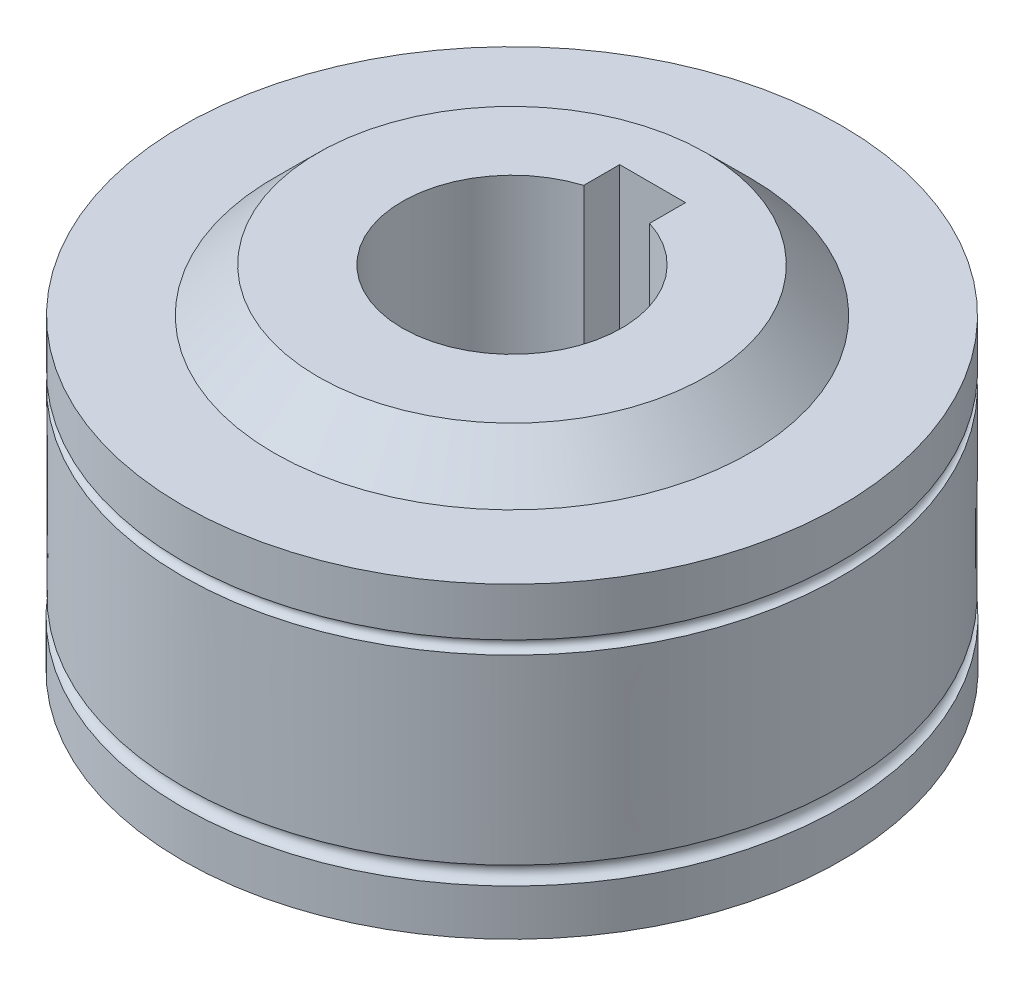
ISO-10303-21;
HEADER;
FILE_DESCRIPTION(('STEP AP214'),'2;1');
FILE_NAME('part.step','',(''),(''),'','','');
FILE_SCHEMA(('AUTOMOTIVE_DESIGN { 1 0 10303 214 1 1 1 1 }'));
ENDSEC;
DATA;
#1=APPLICATION_CONTEXT('core data for automotive mechanical design processes');
#2=APPLICATION_PROTOCOL_DEFINITION('international standard','automotive_design',2000,#1);
#3=PRODUCT_CONTEXT('',#1,'mechanical');
#4=PRODUCT('Part','Part','',(#3));
#5=PRODUCT_RELATED_PRODUCT_CATEGORY('part','',(#4));
#6=PRODUCT_DEFINITION_FORMATION('','',#4);
#7=PRODUCT_DEFINITION_CONTEXT('part definition',#1,'design');
#8=PRODUCT_DEFINITION('design','',#6,#7);
#9=PRODUCT_DEFINITION_SHAPE('','',#8);
#10=(LENGTH_UNIT() NAMED_UNIT(*) SI_UNIT(.MILLI.,.METRE.));
#11=(NAMED_UNIT(*) PLANE_ANGLE_UNIT() SI_UNIT($,.RADIAN.));
#12=(NAMED_UNIT(*) SI_UNIT($,.STERADIAN.) SOLID_ANGLE_UNIT());
#13=UNCERTAINTY_MEASURE_WITH_UNIT(LENGTH_MEASURE(1.E-05),#10,'distance_accuracy_value','');
#14=(GEOMETRIC_REPRESENTATION_CONTEXT(3) GLOBAL_UNCERTAINTY_ASSIGNED_CONTEXT((#13)) GLOBAL_UNIT_ASSIGNED_CONTEXT((#10,
#11,#12)) REPRESENTATION_CONTEXT('',''));
#15=CARTESIAN_POINT('',(0.,0.,0.));
#16=DIRECTION('',(0.,0.,1.));
#17=DIRECTION('',(1.,0.,0.));
#18=AXIS2_PLACEMENT_3D('',#15,#16,#17);
#19=CARTESIAN_POINT('',(0.,-9.,-8.84002342260273));
#20=DIRECTION('',(0.,-1.,0.));
#21=DIRECTION('',(0.,0.,-1.));
#22=AXIS2_PLACEMENT_3D('',#19,#20,#21);
#23=PLANE('',#22);
#24=DIRECTION('',(0.,0.,1.));
#25=VECTOR('',#24,1.);
#26=CARTESIAN_POINT('',(-1.5,-9.,-4.));
#27=LINE('',#26,#25);
#28=CARTESIAN_POINT('',(-1.5,-9.,-6.4056612472711));
#29=VERTEX_POINT('',#28);
#30=CARTESIAN_POINT('',(-1.5,-9.,-4.76969600708473));
#31=VERTEX_POINT('',#30);
#32=EDGE_CURVE('E81',#29,#31,#27,.T.);
#33=ORIENTED_EDGE('',*,*,#32,.T.);
#34=CARTESIAN_POINT('',(0.,-9.,0.));
#35=DIRECTION('',(0.,1.,0.));
#36=DIRECTION('',(0.,0.,1.));
#37=AXIS2_PLACEMENT_3D('',#34,#35,#36);
#38=CIRCLE('',#37,5.);
#39=CARTESIAN_POINT('',(1.5,-9.,-4.76969600708473));
#40=VERTEX_POINT('',#39);
#41=EDGE_CURVE('E91',#31,#40,#38,.T.);
#42=ORIENTED_EDGE('',*,*,#41,.T.);
#43=DIRECTION('',(0.,0.,-1.));
#44=VECTOR('',#43,1.);
#45=CARTESIAN_POINT('',(1.5,-9.,-6.4056612472711));
#46=LINE('',#45,#44);
#47=CARTESIAN_POINT('',(1.5,-9.,-6.4056612472711));
#48=VERTEX_POINT('',#47);
#49=EDGE_CURVE('E49',#40,#48,#46,.T.);
#50=ORIENTED_EDGE('',*,*,#49,.T.);
#51=DIRECTION('',(-1.,0.,0.));
#52=VECTOR('',#51,1.);
#53=CARTESIAN_POINT('',(-1.5,-9.,-6.4056612472711));
#54=LINE('',#53,#52);
#55=EDGE_CURVE('E84',#48,#29,#54,.T.);
#56=ORIENTED_EDGE('',*,*,#55,.T.);
#57=EDGE_LOOP('',(#33,#42,#50,#56));
#58=FACE_BOUND('',#57,.T.);
#59=CARTESIAN_POINT('',(0.,-8.99999999999999,0.));
#60=DIRECTION('',(0.,1.,0.));
#61=DIRECTION('',(0.,0.,1.));
#62=AXIS2_PLACEMENT_3D('',#59,#60,#61);
#63=CIRCLE('',#62,8.84002342260272);
#64=CARTESIAN_POINT('',(0.,-9.,8.84002342260272));
#65=VERTEX_POINT('',#64);
#66=EDGE_CURVE('E132',#65,#65,#63,.T.);
#67=ORIENTED_EDGE('',*,*,#66,.F.);
#68=EDGE_LOOP('',(#67));
#69=FACE_BOUND('',#68,.T.);
#70=ADVANCED_FACE('F35',(#58,#69),#23,.T.);
#71=CARTESIAN_POINT('',(0.,-7.,0.));
#72=DIRECTION('',(0.,1.,0.));
#73=DIRECTION('',(0.,0.,1.));
#74=AXIS2_PLACEMENT_3D('',#71,#72,#73);
#75=CONICAL_SURFACE('',#74,10.8508824151108,0.788105555005152);
#76=ORIENTED_EDGE('',*,*,#66,.T.);
#77=EDGE_LOOP('',(#76));
#78=FACE_BOUND('',#77,.T.);
#79=CARTESIAN_POINT('',(0.,-7.,0.));
#80=DIRECTION('',(0.,1.,0.));
#81=DIRECTION('',(0.,0.,1.));
#82=AXIS2_PLACEMENT_3D('',#79,#80,#81);
#83=CIRCLE('',#82,10.8508824151108);
#84=CARTESIAN_POINT('',(0.,-7.,10.8508824151108));
#85=VERTEX_POINT('',#84);
#86=EDGE_CURVE('E129',#85,#85,#83,.T.);
#87=ORIENTED_EDGE('',*,*,#86,.F.);
#88=EDGE_LOOP('',(#87));
#89=FACE_BOUND('',#88,.T.);
#90=ADVANCED_FACE('F153',(#78,#89),#75,.T.);
#91=CARTESIAN_POINT('',(0.,-7.,-15.01730453128));
#92=DIRECTION('',(0.,-1.,0.));
#93=DIRECTION('',(0.,0.,-1.));
#94=AXIS2_PLACEMENT_3D('',#91,#92,#93);
#95=PLANE('',#94);
#96=ORIENTED_EDGE('',*,*,#86,.T.);
#97=EDGE_LOOP('',(#96));
#98=FACE_BOUND('',#97,.T.);
#99=CARTESIAN_POINT('',(0.,-7.,0.));
#100=DIRECTION('',(0.,1.,0.));
#101=DIRECTION('',(0.,0.,1.));
#102=AXIS2_PLACEMENT_3D('',#99,#100,#101);
#103=CIRCLE('',#102,15.01730453128);
#104=CARTESIAN_POINT('',(0.,-7.,15.01730453128));
#105=VERTEX_POINT('',#104);
#106=EDGE_CURVE('E126',#105,#105,#103,.T.);
#107=ORIENTED_EDGE('',*,*,#106,.F.);
#108=EDGE_LOOP('',(#107));
#109=FACE_BOUND('',#108,.T.);
#110=ADVANCED_FACE('F157',(#98,#109),#95,.T.);
#111=CARTESIAN_POINT('',(0.,26.6331730643921,0.));
#112=DIRECTION('',(0.,1.,0.));
#113=DIRECTION('',(0.,0.,1.));
#114=AXIS2_PLACEMENT_3D('',#111,#112,#113);
#115=CYLINDRICAL_SURFACE('',#114,15.01730453128);
#116=CARTESIAN_POINT('',(0.,-4.89962551619882,0.));
#117=DIRECTION('',(0.,1.,0.));
#118=DIRECTION('',(0.,0.,1.));
#119=AXIS2_PLACEMENT_3D('',#116,#117,#118);
#120=CIRCLE('',#119,15.01730453128);
#121=CARTESIAN_POINT('',(0.,-4.89962551619883,15.01730453128));
#122=VERTEX_POINT('',#121);
#123=EDGE_CURVE('E123',#122,#122,#120,.T.);
#124=ORIENTED_EDGE('',*,*,#123,.F.);
#125=EDGE_LOOP('',(#124));
#126=FACE_BOUND('',#125,.T.);
#127=ORIENTED_EDGE('',*,*,#106,.T.);
#128=EDGE_LOOP('',(#127));
#129=FACE_BOUND('',#128,.T.);
#130=ADVANCED_FACE('F162',(#126,#129),#115,.T.);
#131=CARTESIAN_POINT('',(0.,-4.5,0.));
#132=DIRECTION('',(0.,1.,0.));
#133=DIRECTION('',(0.,0.,1.));
#134=AXIS2_PLACEMENT_3D('',#131,#132,#133);
#135=TOROIDAL_SURFACE('',#134,15.,0.399999999999999);
#136=CARTESIAN_POINT('',(0.,-4.10037448380117,0.));
#137=DIRECTION('',(0.,1.,0.));
#138=DIRECTION('',(0.,0.,1.));
#139=AXIS2_PLACEMENT_3D('',#136,#137,#138);
#140=CIRCLE('',#139,14.98269546872);
#141=CARTESIAN_POINT('',(0.,-4.10037448380117,14.98269546872));
#142=VERTEX_POINT('',#141);
#143=EDGE_CURVE('E120',#142,#142,#140,.T.);
#144=ORIENTED_EDGE('',*,*,#143,.F.);
#145=EDGE_LOOP('',(#144));
#146=FACE_BOUND('',#145,.T.);
#147=ORIENTED_EDGE('',*,*,#123,.T.);
#148=EDGE_LOOP('',(#147));
#149=FACE_BOUND('',#148,.T.);
#150=ADVANCED_FACE('F169',(#146,#149),#135,.F.);
#151=CARTESIAN_POINT('',(0.,4.2,0.));
#152=DIRECTION('',(0.,1.,0.));
#153=DIRECTION('',(0.,0.,1.));
#154=AXIS2_PLACEMENT_3D('',#151,#152,#153);
#155=CONICAL_SURFACE('',#154,15.,0.00208478620372108);
#156=ORIENTED_EDGE('',*,*,#143,.T.);
#157=EDGE_LOOP('',(#156));
#158=FACE_BOUND('',#157,.T.);
#159=CARTESIAN_POINT('',(0.,4.2,0.));
#160=DIRECTION('',(0.,1.,0.));
#161=DIRECTION('',(0.,0.,1.));
#162=AXIS2_PLACEMENT_3D('',#159,#160,#161);
#163=CIRCLE('',#162,15.);
#164=CARTESIAN_POINT('',(0.,4.19999999999999,15.));
#165=VERTEX_POINT('',#164);
#166=EDGE_CURVE('E117',#165,#165,#163,.T.);
#167=ORIENTED_EDGE('',*,*,#166,.F.);
#168=EDGE_LOOP('',(#167));
#169=FACE_BOUND('',#168,.T.);
#170=ADVANCED_FACE('F173',(#158,#169),#155,.T.);
#171=CARTESIAN_POINT('',(0.,4.5,0.));
#172=DIRECTION('',(0.,1.,0.));
#173=DIRECTION('',(0.,0.,1.));
#174=AXIS2_PLACEMENT_3D('',#171,#172,#173);
#175=TOROIDAL_SURFACE('',#174,15.,0.3);
#176=ORIENTED_EDGE('',*,*,#166,.T.);
#177=EDGE_LOOP('',(#176));
#178=FACE_BOUND('',#177,.T.);
#179=CARTESIAN_POINT('',(0.,4.8,0.));
#180=DIRECTION('',(0.,1.,0.));
#181=DIRECTION('',(0.,0.,1.));
#182=AXIS2_PLACEMENT_3D('',#179,#180,#181);
#183=CIRCLE('',#182,15.);
#184=CARTESIAN_POINT('',(0.,4.79999999999999,15.));
#185=VERTEX_POINT('',#184);
#186=EDGE_CURVE('E114',#185,#185,#183,.T.);
#187=ORIENTED_EDGE('',*,*,#186,.F.);
#188=EDGE_LOOP('',(#187));
#189=FACE_BOUND('',#188,.T.);
#190=ADVANCED_FACE('F177',(#178,#189),#175,.F.);
#191=CARTESIAN_POINT('',(0.,26.6331730643921,0.));
#192=DIRECTION('',(0.,1.,0.));
#193=DIRECTION('',(0.,0.,1.));
#194=AXIS2_PLACEMENT_3D('',#191,#192,#193);
#195=CYLINDRICAL_SURFACE('',#194,15.);
#196=ORIENTED_EDGE('',*,*,#186,.T.);
#197=EDGE_LOOP('',(#196));
#198=FACE_BOUND('',#197,.T.);
#199=CARTESIAN_POINT('',(0.,7.,0.));
#200=DIRECTION('',(0.,1.,0.));
#201=DIRECTION('',(0.,0.,1.));
#202=AXIS2_PLACEMENT_3D('',#199,#200,#201);
#203=CIRCLE('',#202,15.);
#204=CARTESIAN_POINT('',(0.,6.99999999999999,15.));
#205=VERTEX_POINT('',#204);
#206=EDGE_CURVE('E111',#205,#205,#203,.T.);
#207=ORIENTED_EDGE('',*,*,#206,.F.);
#208=EDGE_LOOP('',(#207));
#209=FACE_BOUND('',#208,.T.);
#210=ADVANCED_FACE('F181',(#198,#209),#195,.T.);
#211=CARTESIAN_POINT('',(0.,7.,-15.));
#212=DIRECTION('',(0.,-1.,0.));
#213=DIRECTION('',(0.,0.,-1.));
#214=AXIS2_PLACEMENT_3D('',#211,#212,#213);
#215=PLANE('',#214);
#216=CARTESIAN_POINT('',(0.,7.,0.));
#217=DIRECTION('',(0.,1.,0.));
#218=DIRECTION('',(0.,0.,1.));
#219=AXIS2_PLACEMENT_3D('',#216,#217,#218);
#220=CIRCLE('',#219,10.8508824151108);
#221=CARTESIAN_POINT('',(0.,7.,10.8508824151108));
#222=VERTEX_POINT('',#221);
#223=EDGE_CURVE('E108',#222,#222,#220,.T.);
#224=ORIENTED_EDGE('',*,*,#223,.F.);
#225=EDGE_LOOP('',(#224));
#226=FACE_BOUND('',#225,.T.);
#227=ORIENTED_EDGE('',*,*,#206,.T.);
#228=EDGE_LOOP('',(#227));
#229=FACE_BOUND('',#228,.T.);
#230=ADVANCED_FACE('F185',(#226,#229),#215,.F.);
#231=CARTESIAN_POINT('',(0.,7.,0.));
#232=DIRECTION('',(0.,-1.,0.));
#233=DIRECTION('',(0.,0.,-1.));
#234=AXIS2_PLACEMENT_3D('',#231,#232,#233);
#235=CONICAL_SURFACE('',#234,10.8508824151108,0.788105555005151);
#236=CARTESIAN_POINT('',(0.,9.,0.));
#237=DIRECTION('',(0.,1.,0.));
#238=DIRECTION('',(0.,0.,1.));
#239=AXIS2_PLACEMENT_3D('',#236,#237,#238);
#240=CIRCLE('',#239,8.84002342260273);
#241=CARTESIAN_POINT('',(0.,9.,8.84002342260273));
#242=VERTEX_POINT('',#241);
#243=EDGE_CURVE('E105',#242,#242,#240,.T.);
#244=ORIENTED_EDGE('',*,*,#243,.F.);
#245=EDGE_LOOP('',(#244));
#246=FACE_BOUND('',#245,.T.);
#247=ORIENTED_EDGE('',*,*,#223,.T.);
#248=EDGE_LOOP('',(#247));
#249=FACE_BOUND('',#248,.T.);
#250=ADVANCED_FACE('F149',(#246,#249),#235,.T.);
#251=CARTESIAN_POINT('',(0.,9.,-8.84002342260273));
#252=DIRECTION('',(0.,-1.,0.));
#253=DIRECTION('',(0.,0.,-1.));
#254=AXIS2_PLACEMENT_3D('',#251,#252,#253);
#255=PLANE('',#254);
#256=CARTESIAN_POINT('',(0.,9.,0.));
#257=DIRECTION('',(0.,1.,0.));
#258=DIRECTION('',(0.,0.,1.));
#259=AXIS2_PLACEMENT_3D('',#256,#257,#258);
#260=CIRCLE('',#259,5.);
#261=CARTESIAN_POINT('',(-1.5,8.99999999999999,-4.76969600708473));
#262=VERTEX_POINT('',#261);
#263=CARTESIAN_POINT('',(1.5,8.99999999999999,-4.76969600708473));
#264=VERTEX_POINT('',#263);
#265=EDGE_CURVE('E102',#262,#264,#260,.T.);
#266=ORIENTED_EDGE('',*,*,#265,.F.);
#267=DIRECTION('',(0.,0.,1.));
#268=VECTOR('',#267,1.);
#269=CARTESIAN_POINT('',(-1.5,9.,-4.));
#270=LINE('',#269,#268);
#271=CARTESIAN_POINT('',(-1.5,9.,-6.4056612472711));
#272=VERTEX_POINT('',#271);
#273=EDGE_CURVE('E92',#272,#262,#270,.T.);
#274=ORIENTED_EDGE('',*,*,#273,.F.);
#275=DIRECTION('',(-1.,0.,0.));
#276=VECTOR('',#275,1.);
#277=CARTESIAN_POINT('',(-1.5,9.,-6.4056612472711));
#278=LINE('',#277,#276);
#279=CARTESIAN_POINT('',(1.5,9.,-6.4056612472711));
#280=VERTEX_POINT('',#279);
#281=EDGE_CURVE('E94',#280,#272,#278,.T.);
#282=ORIENTED_EDGE('',*,*,#281,.F.);
#283=DIRECTION('',(0.,0.,-1.));
#284=VECTOR('',#283,1.);
#285=CARTESIAN_POINT('',(1.5,9.,-6.4056612472711));
#286=LINE('',#285,#284);
#287=EDGE_CURVE('E76',#264,#280,#286,.T.);
#288=ORIENTED_EDGE('',*,*,#287,.F.);
#289=EDGE_LOOP('',(#266,#274,#282,#288));
#290=FACE_BOUND('',#289,.T.);
#291=ORIENTED_EDGE('',*,*,#243,.T.);
#292=EDGE_LOOP('',(#291));
#293=FACE_BOUND('',#292,.T.);
#294=ADVANCED_FACE('F137',(#290,#293),#255,.F.);
#295=CARTESIAN_POINT('',(0.,26.6331730643921,0.));
#296=DIRECTION('',(0.,1.,0.));
#297=DIRECTION('',(0.,0.,1.));
#298=AXIS2_PLACEMENT_3D('',#295,#296,#297);
#299=CYLINDRICAL_SURFACE('',#298,5.);
#300=DIRECTION('',(0.,1.,0.));
#301=VECTOR('',#300,1.);
#302=CARTESIAN_POINT('',(-1.5,26.6331730643921,-4.76969600708473));
#303=LINE('',#302,#301);
#304=EDGE_CURVE('E11',#262,#31,#303,.F.);
#305=ORIENTED_EDGE('',*,*,#304,.F.);
#306=ORIENTED_EDGE('',*,*,#265,.T.);
#307=DIRECTION('',(0.,1.,0.));
#308=VECTOR('',#307,1.);
#309=CARTESIAN_POINT('',(1.5,26.6331730643921,-4.76969600708473));
#310=LINE('',#309,#308);
#311=EDGE_CURVE('E42',#40,#264,#310,.T.);
#312=ORIENTED_EDGE('',*,*,#311,.F.);
#313=ORIENTED_EDGE('',*,*,#41,.F.);
#314=EDGE_LOOP('',(#305,#306,#312,#313));
#315=FACE_BOUND('',#314,.T.);
#316=ADVANCED_FACE('F140',(#315),#299,.F.);
#317=CARTESIAN_POINT('',(-1.5,-9.,-4.));
#318=DIRECTION('',(-1.,0.,0.));
#319=DIRECTION('',(0.,0.,1.));
#320=AXIS2_PLACEMENT_3D('',#317,#318,#319);
#321=PLANE('',#320);
#322=ORIENTED_EDGE('',*,*,#304,.T.);
#323=ORIENTED_EDGE('',*,*,#32,.F.);
#324=DIRECTION('',(0.,1.,0.));
#325=VECTOR('',#324,1.);
#326=CARTESIAN_POINT('',(-1.5,-9.,-6.4056612472711));
#327=LINE('',#326,#325);
#328=EDGE_CURVE('E80',#29,#272,#327,.T.);
#329=ORIENTED_EDGE('',*,*,#328,.T.);
#330=ORIENTED_EDGE('',*,*,#273,.T.);
#331=EDGE_LOOP('',(#322,#323,#329,#330));
#332=FACE_BOUND('',#331,.T.);
#333=ADVANCED_FACE('F142',(#332),#321,.F.);
#334=CARTESIAN_POINT('',(-1.5,-9.,-6.4056612472711));
#335=DIRECTION('',(0.,0.,-1.));
#336=DIRECTION('',(0.,1.,0.));
#337=AXIS2_PLACEMENT_3D('',#334,#335,#336);
#338=PLANE('',#337);
#339=ORIENTED_EDGE('',*,*,#281,.T.);
#340=ORIENTED_EDGE('',*,*,#328,.F.);
#341=ORIENTED_EDGE('',*,*,#55,.F.);
#342=DIRECTION('',(0.,1.,0.));
#343=VECTOR('',#342,1.);
#344=CARTESIAN_POINT('',(1.5,-9.,-6.4056612472711));
#345=LINE('',#344,#343);
#346=EDGE_CURVE('E72',#48,#280,#345,.T.);
#347=ORIENTED_EDGE('',*,*,#346,.T.);
#348=EDGE_LOOP('',(#339,#340,#341,#347));
#349=FACE_BOUND('',#348,.T.);
#350=ADVANCED_FACE('F85',(#349),#338,.F.);
#351=CARTESIAN_POINT('',(1.5,-9.,-6.4056612472711));
#352=DIRECTION('',(1.,0.,0.));
#353=DIRECTION('',(0.,0.,-1.));
#354=AXIS2_PLACEMENT_3D('',#351,#352,#353);
#355=PLANE('',#354);
#356=ORIENTED_EDGE('',*,*,#311,.T.);
#357=ORIENTED_EDGE('',*,*,#287,.T.);
#358=ORIENTED_EDGE('',*,*,#346,.F.);
#359=ORIENTED_EDGE('',*,*,#49,.F.);
#360=EDGE_LOOP('',(#356,#357,#358,#359));
#361=FACE_BOUND('',#360,.T.);
#362=ADVANCED_FACE('F74',(#361),#355,.F.);
#363=CLOSED_SHELL('',(#70,#90,#110,#130,#150,#170,#190,#210,#230,#250,#294,#316,#333,#350,#362));
#364=MANIFOLD_SOLID_BREP('B2',#363);
#365=ADVANCED_BREP_SHAPE_REPRESENTATION('',(#18,#364),#14);
#366=SHAPE_DEFINITION_REPRESENTATION(#9,#365);
ENDSEC;
END-ISO-10303-21;
